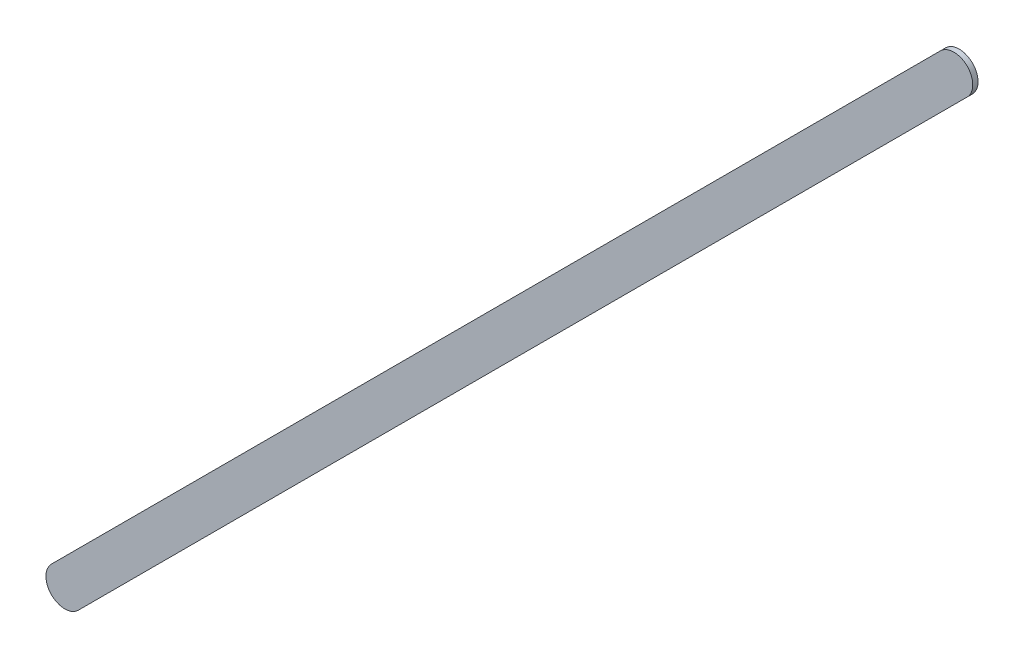
ISO-10303-21;
HEADER;
FILE_DESCRIPTION(('STEP AP214'),'2;1');
FILE_NAME('part.step','',(''),(''),'','','');
FILE_SCHEMA(('AUTOMOTIVE_DESIGN { 1 0 10303 214 1 1 1 1 }'));
ENDSEC;
DATA;
#1=APPLICATION_CONTEXT('core data for automotive mechanical design processes');
#2=APPLICATION_PROTOCOL_DEFINITION('international standard','automotive_design',2000,#1);
#3=PRODUCT_CONTEXT('',#1,'mechanical');
#4=PRODUCT('Part','Part','',(#3));
#5=PRODUCT_RELATED_PRODUCT_CATEGORY('part','',(#4));
#6=PRODUCT_DEFINITION_FORMATION('','',#4);
#7=PRODUCT_DEFINITION_CONTEXT('part definition',#1,'design');
#8=PRODUCT_DEFINITION('design','',#6,#7);
#9=PRODUCT_DEFINITION_SHAPE('','',#8);
#10=(LENGTH_UNIT() NAMED_UNIT(*) SI_UNIT(.MILLI.,.METRE.));
#11=(NAMED_UNIT(*) PLANE_ANGLE_UNIT() SI_UNIT($,.RADIAN.));
#12=(NAMED_UNIT(*) SI_UNIT($,.STERADIAN.) SOLID_ANGLE_UNIT());
#13=UNCERTAINTY_MEASURE_WITH_UNIT(LENGTH_MEASURE(1.E-05),#10,'distance_accuracy_value','');
#14=(GEOMETRIC_REPRESENTATION_CONTEXT(3) GLOBAL_UNCERTAINTY_ASSIGNED_CONTEXT((#13)) GLOBAL_UNIT_ASSIGNED_CONTEXT((#10,
#11,#12)) REPRESENTATION_CONTEXT('',''));
#15=CARTESIAN_POINT('',(0.,0.,0.));
#16=DIRECTION('',(0.,0.,1.));
#17=DIRECTION('',(1.,0.,0.));
#18=AXIS2_PLACEMENT_3D('',#15,#16,#17);
#19=CARTESIAN_POINT('',(80.5067732,79.59716872,0.));
#20=DIRECTION('',(-0.707106931357732,0.707106631015331,0.));
#21=DIRECTION('',(0.707106631015331,0.707106931357732,0.));
#22=AXIS2_PLACEMENT_3D('',#19,#20,#21);
#23=PLANE('',#22);
#24=DIRECTION('',(0.707106631015331,0.707106931357732,0.));
#25=VECTOR('',#24,1.);
#26=CARTESIAN_POINT('',(80.5067732,79.59716872,0.03556));
#27=LINE('',#26,#25);
#28=CARTESIAN_POINT('',(80.5067732,79.59716872,0.03556));
#29=VERTEX_POINT('',#28);
#30=CARTESIAN_POINT('',(86.4867841,85.57718216,0.03556));
#31=VERTEX_POINT('',#30);
#32=EDGE_CURVE('E11',#29,#31,#27,.T.);
#33=ORIENTED_EDGE('',*,*,#32,.F.);
#34=DIRECTION('',(0.,0.,1.));
#35=VECTOR('',#34,1.);
#36=CARTESIAN_POINT('',(80.5067732,79.59716872,0.));
#37=LINE('',#36,#35);
#38=CARTESIAN_POINT('',(80.5067732,79.59716872,0.));
#39=VERTEX_POINT('',#38);
#40=EDGE_CURVE('E24',#39,#29,#37,.T.);
#41=ORIENTED_EDGE('',*,*,#40,.F.);
#42=DIRECTION('',(0.707106631015331,0.707106931357732,0.));
#43=VECTOR('',#42,1.);
#44=CARTESIAN_POINT('',(80.5067732,79.59716872,0.));
#45=LINE('',#44,#43);
#46=CARTESIAN_POINT('',(86.4867841,85.57718216,0.));
#47=VERTEX_POINT('',#46);
#48=EDGE_CURVE('E75',#39,#47,#45,.T.);
#49=ORIENTED_EDGE('',*,*,#48,.T.);
#50=DIRECTION('',(0.,0.,1.));
#51=VECTOR('',#50,1.);
#52=CARTESIAN_POINT('',(86.4867841,85.57718216,0.));
#53=LINE('',#52,#51);
#54=EDGE_CURVE('E37',#47,#31,#53,.T.);
#55=ORIENTED_EDGE('',*,*,#54,.T.);
#56=EDGE_LOOP('',(#33,#41,#49,#55));
#57=FACE_BOUND('',#56,.T.);
#58=ADVANCED_FACE('F17',(#57),#23,.F.);
#59=CARTESIAN_POINT('',(86.3969824,85.66698386,0.));
#60=DIRECTION('',(0.,0.,-1.));
#61=DIRECTION('',(0.707106781186604,-0.707106781186492,0.));
#62=AXIS2_PLACEMENT_3D('',#59,#60,#61);
#63=CYLINDRICAL_SURFACE('',#62,0.12699878206417);
#64=CARTESIAN_POINT('',(86.3969824,85.66698386,0.03556));
#65=DIRECTION('',(0.,0.,1.));
#66=DIRECTION('',(0.707106781186604,-0.707106781186492,0.));
#67=AXIS2_PLACEMENT_3D('',#64,#65,#66);
#68=CIRCLE('',#67,0.12699878206417);
#69=CARTESIAN_POINT('',(86.3071807,85.75678556,0.03556));
#70=VERTEX_POINT('',#69);
#71=EDGE_CURVE('E83',#31,#70,#68,.T.);
#72=ORIENTED_EDGE('',*,*,#71,.F.);
#73=ORIENTED_EDGE('',*,*,#54,.F.);
#74=CARTESIAN_POINT('',(86.3969824,85.66698386,0.));
#75=DIRECTION('',(0.,0.,1.));
#76=DIRECTION('',(0.707106781186604,-0.707106781186492,0.));
#77=AXIS2_PLACEMENT_3D('',#74,#75,#76);
#78=CIRCLE('',#77,0.12699878206417);
#79=CARTESIAN_POINT('',(86.3071807,85.75678556,0.));
#80=VERTEX_POINT('',#79);
#81=EDGE_CURVE('E81',#47,#80,#78,.T.);
#82=ORIENTED_EDGE('',*,*,#81,.T.);
#83=DIRECTION('',(0.,0.,1.));
#84=VECTOR('',#83,1.);
#85=CARTESIAN_POINT('',(86.3071807,85.75678556,0.));
#86=LINE('',#85,#84);
#87=EDGE_CURVE('E67',#80,#70,#86,.T.);
#88=ORIENTED_EDGE('',*,*,#87,.T.);
#89=EDGE_LOOP('',(#72,#73,#82,#88));
#90=FACE_BOUND('',#89,.T.);
#91=ADVANCED_FACE('F89',(#90),#63,.T.);
#92=CARTESIAN_POINT('',(86.3071807,85.75678556,0.));
#93=DIRECTION('',(0.70710663101533,-0.707106931357733,0.));
#94=DIRECTION('',(-0.707106931357733,-0.70710663101533,0.));
#95=AXIS2_PLACEMENT_3D('',#92,#93,#94);
#96=PLANE('',#95);
#97=DIRECTION('',(-0.707106931357733,-0.70710663101533,0.));
#98=VECTOR('',#97,1.);
#99=CARTESIAN_POINT('',(86.3071807,85.75678556,0.03556));
#100=LINE('',#99,#98);
#101=CARTESIAN_POINT('',(80.32716726,79.77677466,0.03556));
#102=VERTEX_POINT('',#101);
#103=EDGE_CURVE('E71',#70,#102,#100,.T.);
#104=ORIENTED_EDGE('',*,*,#103,.F.);
#105=ORIENTED_EDGE('',*,*,#87,.F.);
#106=DIRECTION('',(-0.707106931357733,-0.70710663101533,0.));
#107=VECTOR('',#106,1.);
#108=CARTESIAN_POINT('',(86.3071807,85.75678556,0.));
#109=LINE('',#108,#107);
#110=CARTESIAN_POINT('',(80.32716726,79.77677466,0.));
#111=VERTEX_POINT('',#110);
#112=EDGE_CURVE('E63',#80,#111,#109,.T.);
#113=ORIENTED_EDGE('',*,*,#112,.T.);
#114=DIRECTION('',(0.,0.,1.));
#115=VECTOR('',#114,1.);
#116=CARTESIAN_POINT('',(80.32716726,79.77677466,0.));
#117=LINE('',#116,#115);
#118=EDGE_CURVE('E53',#111,#102,#117,.T.);
#119=ORIENTED_EDGE('',*,*,#118,.T.);
#120=EDGE_LOOP('',(#104,#105,#113,#119));
#121=FACE_BOUND('',#120,.T.);
#122=ADVANCED_FACE('F66',(#121),#96,.F.);
#123=CARTESIAN_POINT('',(80.41697023,79.68697169,0.));
#124=DIRECTION('',(0.,0.,-1.));
#125=DIRECTION('',(-0.707106781186604,0.707106781186492,0.));
#126=AXIS2_PLACEMENT_3D('',#123,#124,#125);
#127=CYLINDRICAL_SURFACE('',#126,0.127000578115389);
#128=CARTESIAN_POINT('',(80.41697023,79.68697169,0.03556));
#129=DIRECTION('',(0.,0.,1.));
#130=DIRECTION('',(-0.707106781186604,0.707106781186492,0.));
#131=AXIS2_PLACEMENT_3D('',#128,#129,#130);
#132=CIRCLE('',#131,0.127000578115389);
#133=EDGE_CURVE('E59',#102,#29,#132,.T.);
#134=ORIENTED_EDGE('',*,*,#133,.F.);
#135=ORIENTED_EDGE('',*,*,#118,.F.);
#136=CARTESIAN_POINT('',(80.41697023,79.68697169,0.));
#137=DIRECTION('',(0.,0.,1.));
#138=DIRECTION('',(-0.707106781186604,0.707106781186492,0.));
#139=AXIS2_PLACEMENT_3D('',#136,#137,#138);
#140=CIRCLE('',#139,0.127000578115389);
#141=EDGE_CURVE('E57',#111,#39,#140,.T.);
#142=ORIENTED_EDGE('',*,*,#141,.T.);
#143=ORIENTED_EDGE('',*,*,#40,.T.);
#144=EDGE_LOOP('',(#134,#135,#142,#143));
#145=FACE_BOUND('',#144,.T.);
#146=ADVANCED_FACE('F55',(#145),#127,.T.);
#147=CARTESIAN_POINT('',(80.5067732,79.59716872,0.));
#148=DIRECTION('',(0.,0.,-1.));
#149=DIRECTION('',(-1.,0.,0.));
#150=AXIS2_PLACEMENT_3D('',#147,#148,#149);
#151=PLANE('',#150);
#152=ORIENTED_EDGE('',*,*,#141,.F.);
#153=ORIENTED_EDGE('',*,*,#112,.F.);
#154=ORIENTED_EDGE('',*,*,#81,.F.);
#155=ORIENTED_EDGE('',*,*,#48,.F.);
#156=EDGE_LOOP('',(#152,#153,#154,#155));
#157=FACE_BOUND('',#156,.T.);
#158=ADVANCED_FACE('F74',(#157),#151,.T.);
#159=CARTESIAN_POINT('',(80.5067732,79.59716872,0.03556));
#160=DIRECTION('',(0.,0.,-1.));
#161=DIRECTION('',(-1.,0.,0.));
#162=AXIS2_PLACEMENT_3D('',#159,#160,#161);
#163=PLANE('',#162);
#164=ORIENTED_EDGE('',*,*,#32,.T.);
#165=ORIENTED_EDGE('',*,*,#71,.T.);
#166=ORIENTED_EDGE('',*,*,#103,.T.);
#167=ORIENTED_EDGE('',*,*,#133,.T.);
#168=EDGE_LOOP('',(#164,#165,#166,#167));
#169=FACE_BOUND('',#168,.T.);
#170=ADVANCED_FACE('F91',(#169),#163,.F.);
#171=CLOSED_SHELL('',(#58,#91,#122,#146,#158,#170));
#172=MANIFOLD_SOLID_BREP('B1',#171);
#173=ADVANCED_BREP_SHAPE_REPRESENTATION('',(#18,#172),#14);
#174=SHAPE_DEFINITION_REPRESENTATION(#9,#173);
ENDSEC;
END-ISO-10303-21;
